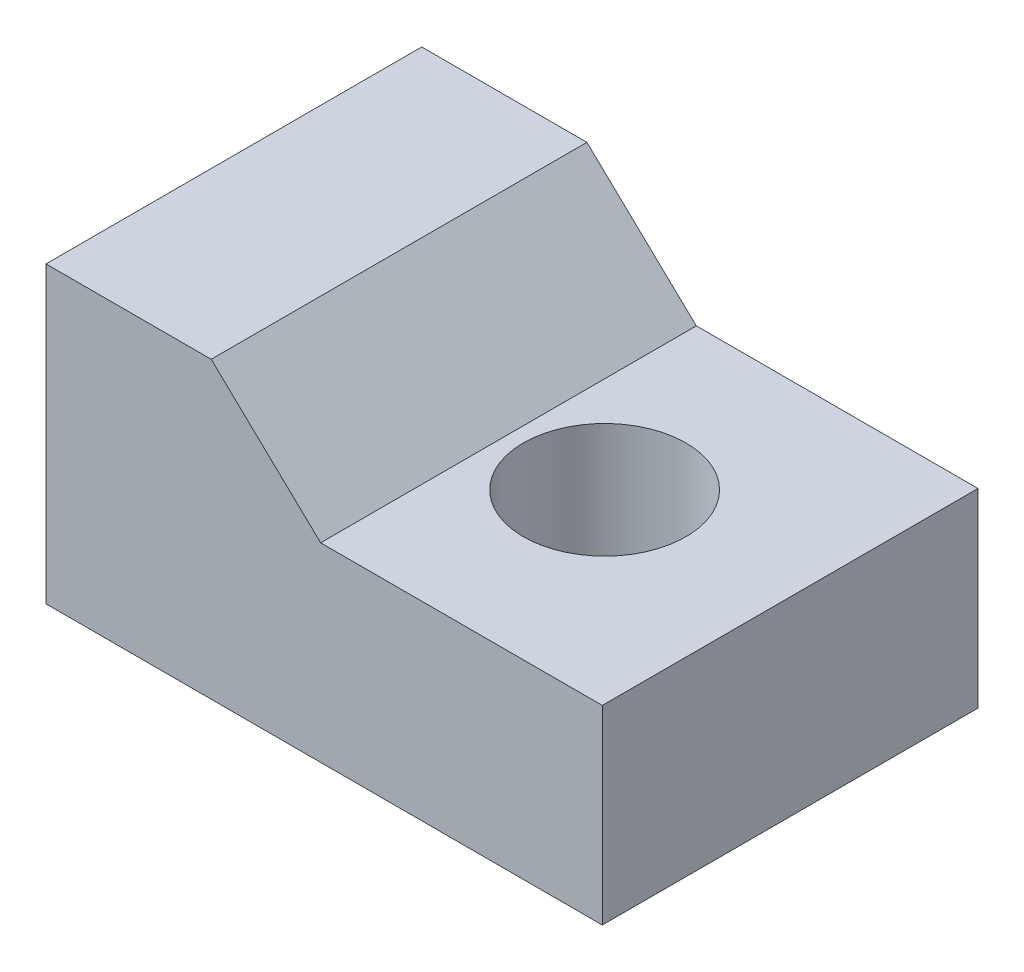
ISO-10303-21;
HEADER;
FILE_DESCRIPTION(('STEP AP214'),'2;1');
FILE_NAME('part.step','',(''),(''),'','','');
FILE_SCHEMA(('AUTOMOTIVE_DESIGN { 1 0 10303 214 1 1 1 1 }'));
ENDSEC;
DATA;
#1=APPLICATION_CONTEXT('core data for automotive mechanical design processes');
#2=APPLICATION_PROTOCOL_DEFINITION('international standard','automotive_design',2000,#1);
#3=PRODUCT_CONTEXT('',#1,'mechanical');
#4=PRODUCT('Part','Part','',(#3));
#5=PRODUCT_RELATED_PRODUCT_CATEGORY('part','',(#4));
#6=PRODUCT_DEFINITION_FORMATION('','',#4);
#7=PRODUCT_DEFINITION_CONTEXT('part definition',#1,'design');
#8=PRODUCT_DEFINITION('design','',#6,#7);
#9=PRODUCT_DEFINITION_SHAPE('','',#8);
#10=(LENGTH_UNIT() NAMED_UNIT(*) SI_UNIT(.MILLI.,.METRE.));
#11=(NAMED_UNIT(*) PLANE_ANGLE_UNIT() SI_UNIT($,.RADIAN.));
#12=(NAMED_UNIT(*) SI_UNIT($,.STERADIAN.) SOLID_ANGLE_UNIT());
#13=UNCERTAINTY_MEASURE_WITH_UNIT(LENGTH_MEASURE(1.E-05),#10,'distance_accuracy_value','');
#14=(GEOMETRIC_REPRESENTATION_CONTEXT(3) GLOBAL_UNCERTAINTY_ASSIGNED_CONTEXT((#13)) GLOBAL_UNIT_ASSIGNED_CONTEXT((#10,
#11,#12)) REPRESENTATION_CONTEXT('',''));
#15=CARTESIAN_POINT('',(0.,0.,0.));
#16=DIRECTION('',(0.,0.,1.));
#17=DIRECTION('',(1.,0.,0.));
#18=AXIS2_PLACEMENT_3D('',#15,#16,#17);
#19=CARTESIAN_POINT('',(27.1145,0.,18.3134));
#20=DIRECTION('',(0.,1.,0.));
#21=DIRECTION('',(-1.,0.,0.));
#22=AXIS2_PLACEMENT_3D('',#19,#20,#21);
#23=PLANE('',#22);
#24=CARTESIAN_POINT('',(18.0721,0.,9.1567));
#25=DIRECTION('',(0.,1.,0.));
#26=DIRECTION('',(-1.,0.,0.));
#27=AXIS2_PLACEMENT_3D('',#24,#25,#26);
#28=CIRCLE('',#27,3.9624);
#29=CARTESIAN_POINT('',(14.1097,0.,9.1567));
#30=VERTEX_POINT('',#29);
#31=EDGE_CURVE('E121',#30,#30,#28,.T.);
#32=ORIENTED_EDGE('',*,*,#31,.T.);
#33=EDGE_LOOP('',(#32));
#34=FACE_BOUND('',#33,.T.);
#35=DIRECTION('',(1.,0.,0.));
#36=VECTOR('',#35,1.);
#37=CARTESIAN_POINT('',(27.1145,0.,0.));
#38=LINE('',#37,#36);
#39=CARTESIAN_POINT('',(0.,0.,0.));
#40=VERTEX_POINT('',#39);
#41=CARTESIAN_POINT('',(27.1145,0.,0.));
#42=VERTEX_POINT('',#41);
#43=EDGE_CURVE('E117',#40,#42,#38,.T.);
#44=ORIENTED_EDGE('',*,*,#43,.T.);
#45=DIRECTION('',(0.,0.,-1.));
#46=VECTOR('',#45,1.);
#47=CARTESIAN_POINT('',(27.1145,0.,18.3134));
#48=LINE('',#47,#46);
#49=CARTESIAN_POINT('',(27.1145,0.,18.3134));
#50=VERTEX_POINT('',#49);
#51=EDGE_CURVE('E11',#50,#42,#48,.T.);
#52=ORIENTED_EDGE('',*,*,#51,.F.);
#53=DIRECTION('',(1.,0.,0.));
#54=VECTOR('',#53,1.);
#55=CARTESIAN_POINT('',(27.1145,0.,18.3134));
#56=LINE('',#55,#54);
#57=CARTESIAN_POINT('',(0.,0.,18.3134));
#58=VERTEX_POINT('',#57);
#59=EDGE_CURVE('E128',#58,#50,#56,.T.);
#60=ORIENTED_EDGE('',*,*,#59,.F.);
#61=DIRECTION('',(0.,0.,-1.));
#62=VECTOR('',#61,1.);
#63=CARTESIAN_POINT('',(0.,0.,18.3134));
#64=LINE('',#63,#62);
#65=EDGE_CURVE('E113',#58,#40,#64,.T.);
#66=ORIENTED_EDGE('',*,*,#65,.T.);
#67=EDGE_LOOP('',(#44,#52,#60,#66));
#68=FACE_BOUND('',#67,.T.);
#69=ADVANCED_FACE('F33',(#34,#68),#23,.F.);
#70=CARTESIAN_POINT('',(27.1145,9.27099999999999,18.3134));
#71=DIRECTION('',(-1.,0.,0.));
#72=DIRECTION('',(0.,0.,1.));
#73=AXIS2_PLACEMENT_3D('',#70,#71,#72);
#74=PLANE('',#73);
#75=DIRECTION('',(0.,1.,0.));
#76=VECTOR('',#75,1.);
#77=CARTESIAN_POINT('',(27.1145,9.27099999999999,0.));
#78=LINE('',#77,#76);
#79=CARTESIAN_POINT('',(27.1145,9.27099999999999,0.));
#80=VERTEX_POINT('',#79);
#81=EDGE_CURVE('E120',#42,#80,#78,.T.);
#82=ORIENTED_EDGE('',*,*,#81,.T.);
#83=DIRECTION('',(0.,0.,-1.));
#84=VECTOR('',#83,1.);
#85=CARTESIAN_POINT('',(27.1145,9.27099999999999,18.3134));
#86=LINE('',#85,#84);
#87=CARTESIAN_POINT('',(27.1145,9.27099999999999,18.3134));
#88=VERTEX_POINT('',#87);
#89=EDGE_CURVE('E41',#88,#80,#86,.T.);
#90=ORIENTED_EDGE('',*,*,#89,.F.);
#91=DIRECTION('',(0.,1.,0.));
#92=VECTOR('',#91,1.);
#93=CARTESIAN_POINT('',(27.1145,9.27099999999999,18.3134));
#94=LINE('',#93,#92);
#95=EDGE_CURVE('E86',#50,#88,#94,.T.);
#96=ORIENTED_EDGE('',*,*,#95,.F.);
#97=ORIENTED_EDGE('',*,*,#51,.T.);
#98=EDGE_LOOP('',(#82,#90,#96,#97));
#99=FACE_BOUND('',#98,.T.);
#100=ADVANCED_FACE('F154',(#99),#74,.F.);
#101=CARTESIAN_POINT('',(13.3858,9.271,18.3134));
#102=DIRECTION('',(0.,-1.,0.));
#103=DIRECTION('',(1.,0.,0.));
#104=AXIS2_PLACEMENT_3D('',#101,#102,#103);
#105=PLANE('',#104);
#106=CARTESIAN_POINT('',(18.0721,9.271,9.1567));
#107=DIRECTION('',(0.,1.,0.));
#108=DIRECTION('',(-1.,0.,0.));
#109=AXIS2_PLACEMENT_3D('',#106,#107,#108);
#110=CIRCLE('',#109,3.9624);
#111=CARTESIAN_POINT('',(14.1097,9.271,9.1567));
#112=VERTEX_POINT('',#111);
#113=EDGE_CURVE('E162',#112,#112,#110,.T.);
#114=ORIENTED_EDGE('',*,*,#113,.F.);
#115=EDGE_LOOP('',(#114));
#116=FACE_BOUND('',#115,.T.);
#117=DIRECTION('',(-1.,0.,0.));
#118=VECTOR('',#117,1.);
#119=CARTESIAN_POINT('',(13.3858,9.271,0.));
#120=LINE('',#119,#118);
#121=CARTESIAN_POINT('',(13.3858,9.271,0.));
#122=VERTEX_POINT('',#121);
#123=EDGE_CURVE('E123',#80,#122,#120,.T.);
#124=ORIENTED_EDGE('',*,*,#123,.T.);
#125=DIRECTION('',(0.,0.,-1.));
#126=VECTOR('',#125,1.);
#127=CARTESIAN_POINT('',(13.3858,9.271,18.3134));
#128=LINE('',#127,#126);
#129=CARTESIAN_POINT('',(13.3858,9.271,18.3134));
#130=VERTEX_POINT('',#129);
#131=EDGE_CURVE('E108',#130,#122,#128,.T.);
#132=ORIENTED_EDGE('',*,*,#131,.F.);
#133=DIRECTION('',(-1.,0.,0.));
#134=VECTOR('',#133,1.);
#135=CARTESIAN_POINT('',(13.3858,9.271,18.3134));
#136=LINE('',#135,#134);
#137=EDGE_CURVE('E99',#88,#130,#136,.T.);
#138=ORIENTED_EDGE('',*,*,#137,.F.);
#139=ORIENTED_EDGE('',*,*,#89,.T.);
#140=EDGE_LOOP('',(#124,#132,#138,#139));
#141=FACE_BOUND('',#140,.T.);
#142=ADVANCED_FACE('F134',(#116,#141),#105,.F.);
#143=CARTESIAN_POINT('',(8.0518,14.351,18.3134));
#144=DIRECTION('',(-0.689655172413793,-0.724137931034483,0.));
#145=DIRECTION('',(0.724137931034483,-0.689655172413793,0.));
#146=AXIS2_PLACEMENT_3D('',#143,#144,#145);
#147=PLANE('',#146);
#148=DIRECTION('',(-0.724137931034483,0.689655172413793,0.));
#149=VECTOR('',#148,1.);
#150=CARTESIAN_POINT('',(8.0518,14.351,0.));
#151=LINE('',#150,#149);
#152=CARTESIAN_POINT('',(8.0518,14.351,0.));
#153=VERTEX_POINT('',#152);
#154=EDGE_CURVE('E107',#122,#153,#151,.T.);
#155=ORIENTED_EDGE('',*,*,#154,.T.);
#156=DIRECTION('',(0.,0.,-1.));
#157=VECTOR('',#156,1.);
#158=CARTESIAN_POINT('',(8.0518,14.351,18.3134));
#159=LINE('',#158,#157);
#160=CARTESIAN_POINT('',(8.0518,14.351,18.3134));
#161=VERTEX_POINT('',#160);
#162=EDGE_CURVE('E104',#161,#153,#159,.T.);
#163=ORIENTED_EDGE('',*,*,#162,.F.);
#164=DIRECTION('',(-0.724137931034483,0.689655172413793,0.));
#165=VECTOR('',#164,1.);
#166=CARTESIAN_POINT('',(8.0518,14.351,18.3134));
#167=LINE('',#166,#165);
#168=EDGE_CURVE('E93',#130,#161,#167,.T.);
#169=ORIENTED_EDGE('',*,*,#168,.F.);
#170=ORIENTED_EDGE('',*,*,#131,.T.);
#171=EDGE_LOOP('',(#155,#163,#169,#170));
#172=FACE_BOUND('',#171,.T.);
#173=ADVANCED_FACE('F105',(#172),#147,.F.);
#174=CARTESIAN_POINT('',(0.,14.351,18.3134));
#175=DIRECTION('',(0.,-1.,0.));
#176=DIRECTION('',(0.,0.,-1.));
#177=AXIS2_PLACEMENT_3D('',#174,#175,#176);
#178=PLANE('',#177);
#179=DIRECTION('',(-1.,0.,0.));
#180=VECTOR('',#179,1.);
#181=CARTESIAN_POINT('',(0.,14.351,0.));
#182=LINE('',#181,#180);
#183=CARTESIAN_POINT('',(0.,14.351,0.));
#184=VERTEX_POINT('',#183);
#185=EDGE_CURVE('E72',#153,#184,#182,.T.);
#186=ORIENTED_EDGE('',*,*,#185,.T.);
#187=DIRECTION('',(0.,0.,-1.));
#188=VECTOR('',#187,1.);
#189=CARTESIAN_POINT('',(0.,14.351,18.3134));
#190=LINE('',#189,#188);
#191=CARTESIAN_POINT('',(0.,14.351,18.3134));
#192=VERTEX_POINT('',#191);
#193=EDGE_CURVE('E109',#192,#184,#190,.T.);
#194=ORIENTED_EDGE('',*,*,#193,.F.);
#195=DIRECTION('',(-1.,0.,0.));
#196=VECTOR('',#195,1.);
#197=CARTESIAN_POINT('',(0.,14.351,18.3134));
#198=LINE('',#197,#196);
#199=EDGE_CURVE('E97',#161,#192,#198,.T.);
#200=ORIENTED_EDGE('',*,*,#199,.F.);
#201=ORIENTED_EDGE('',*,*,#162,.T.);
#202=EDGE_LOOP('',(#186,#194,#200,#201));
#203=FACE_BOUND('',#202,.T.);
#204=ADVANCED_FACE('F111',(#203),#178,.F.);
#205=CARTESIAN_POINT('',(0.,0.,18.3134));
#206=DIRECTION('',(1.,0.,0.));
#207=DIRECTION('',(0.,0.,-1.));
#208=AXIS2_PLACEMENT_3D('',#205,#206,#207);
#209=PLANE('',#208);
#210=CARTESIAN_POINT('',(0.,6.096,9.1567));
#211=DIRECTION('',(-1.,0.,0.));
#212=DIRECTION('',(0.,0.,1.));
#213=AXIS2_PLACEMENT_3D('',#210,#211,#212);
#214=CIRCLE('',#213,3.81);
#215=CARTESIAN_POINT('',(0.,6.096,12.9667));
#216=VERTEX_POINT('',#215);
#217=EDGE_CURVE('E168',#216,#216,#214,.T.);
#218=ORIENTED_EDGE('',*,*,#217,.F.);
#219=EDGE_LOOP('',(#218));
#220=FACE_BOUND('',#219,.T.);
#221=DIRECTION('',(0.,-1.,0.));
#222=VECTOR('',#221,1.);
#223=CARTESIAN_POINT('',(0.,0.,0.));
#224=LINE('',#223,#222);
#225=EDGE_CURVE('E78',#184,#40,#224,.T.);
#226=ORIENTED_EDGE('',*,*,#225,.T.);
#227=ORIENTED_EDGE('',*,*,#65,.F.);
#228=DIRECTION('',(0.,-1.,0.));
#229=VECTOR('',#228,1.);
#230=CARTESIAN_POINT('',(0.,0.,18.3134));
#231=LINE('',#230,#229);
#232=EDGE_CURVE('E49',#192,#58,#231,.T.);
#233=ORIENTED_EDGE('',*,*,#232,.F.);
#234=ORIENTED_EDGE('',*,*,#193,.T.);
#235=EDGE_LOOP('',(#226,#227,#233,#234));
#236=FACE_BOUND('',#235,.T.);
#237=ADVANCED_FACE('F141',(#220,#236),#209,.F.);
#238=CARTESIAN_POINT('',(0.,0.,18.3134));
#239=DIRECTION('',(0.,0.,-1.));
#240=DIRECTION('',(-1.,0.,0.));
#241=AXIS2_PLACEMENT_3D('',#238,#239,#240);
#242=PLANE('',#241);
#243=ORIENTED_EDGE('',*,*,#59,.T.);
#244=ORIENTED_EDGE('',*,*,#95,.T.);
#245=ORIENTED_EDGE('',*,*,#137,.T.);
#246=ORIENTED_EDGE('',*,*,#168,.T.);
#247=ORIENTED_EDGE('',*,*,#199,.T.);
#248=ORIENTED_EDGE('',*,*,#232,.T.);
#249=EDGE_LOOP('',(#243,#244,#245,#246,#247,#248));
#250=FACE_BOUND('',#249,.T.);
#251=ADVANCED_FACE('F95',(#250),#242,.F.);
#252=CARTESIAN_POINT('',(0.,0.,0.));
#253=DIRECTION('',(0.,0.,-1.));
#254=DIRECTION('',(-1.,0.,0.));
#255=AXIS2_PLACEMENT_3D('',#252,#253,#254);
#256=PLANE('',#255);
#257=ORIENTED_EDGE('',*,*,#43,.F.);
#258=ORIENTED_EDGE('',*,*,#225,.F.);
#259=ORIENTED_EDGE('',*,*,#185,.F.);
#260=ORIENTED_EDGE('',*,*,#154,.F.);
#261=ORIENTED_EDGE('',*,*,#123,.F.);
#262=ORIENTED_EDGE('',*,*,#81,.F.);
#263=EDGE_LOOP('',(#257,#258,#259,#260,#261,#262));
#264=FACE_BOUND('',#263,.T.);
#265=ADVANCED_FACE('F137',(#264),#256,.T.);
#266=CARTESIAN_POINT('',(18.0721,0.,9.1567));
#267=DIRECTION('',(0.,1.,0.));
#268=DIRECTION('',(-1.,0.,0.));
#269=AXIS2_PLACEMENT_3D('',#266,#267,#268);
#270=CYLINDRICAL_SURFACE('',#269,3.9624);
#271=ORIENTED_EDGE('',*,*,#31,.F.);
#272=EDGE_LOOP('',(#271));
#273=FACE_BOUND('',#272,.T.);
#274=ORIENTED_EDGE('',*,*,#113,.T.);
#275=EDGE_LOOP('',(#274));
#276=FACE_BOUND('',#275,.T.);
#277=ADVANCED_FACE('F181',(#273,#276),#270,.F.);
#278=CARTESIAN_POINT('',(6.35,6.096,9.1567));
#279=DIRECTION('',(-1.,0.,0.));
#280=DIRECTION('',(0.,0.,1.));
#281=AXIS2_PLACEMENT_3D('',#278,#279,#280);
#282=CYLINDRICAL_SURFACE('',#281,3.81);
#283=CARTESIAN_POINT('',(6.35,6.096,9.1567));
#284=DIRECTION('',(-1.,0.,0.));
#285=DIRECTION('',(0.,0.,1.));
#286=AXIS2_PLACEMENT_3D('',#283,#284,#285);
#287=CIRCLE('',#286,3.81);
#288=CARTESIAN_POINT('',(6.35,6.096,12.9667));
#289=VERTEX_POINT('',#288);
#290=EDGE_CURVE('E165',#289,#289,#287,.T.);
#291=ORIENTED_EDGE('',*,*,#290,.F.);
#292=EDGE_LOOP('',(#291));
#293=FACE_BOUND('',#292,.T.);
#294=ORIENTED_EDGE('',*,*,#217,.T.);
#295=EDGE_LOOP('',(#294));
#296=FACE_BOUND('',#295,.T.);
#297=ADVANCED_FACE('F178',(#293,#296),#282,.F.);
#298=CARTESIAN_POINT('',(6.35,6.096,9.1567));
#299=DIRECTION('',(-1.,0.,0.));
#300=DIRECTION('',(0.,0.,1.));
#301=AXIS2_PLACEMENT_3D('',#298,#299,#300);
#302=PLANE('',#301);
#303=ORIENTED_EDGE('',*,*,#290,.T.);
#304=EDGE_LOOP('',(#303));
#305=FACE_BOUND('',#304,.T.);
#306=ADVANCED_FACE('F176',(#305),#302,.T.);
#307=CLOSED_SHELL('',(#69,#100,#142,#173,#204,#237,#251,#265,#277,#297,#306));
#308=MANIFOLD_SOLID_BREP('B2',#307);
#309=ADVANCED_BREP_SHAPE_REPRESENTATION('',(#18,#308),#14);
#310=SHAPE_DEFINITION_REPRESENTATION(#9,#309);
ENDSEC;
END-ISO-10303-21;
